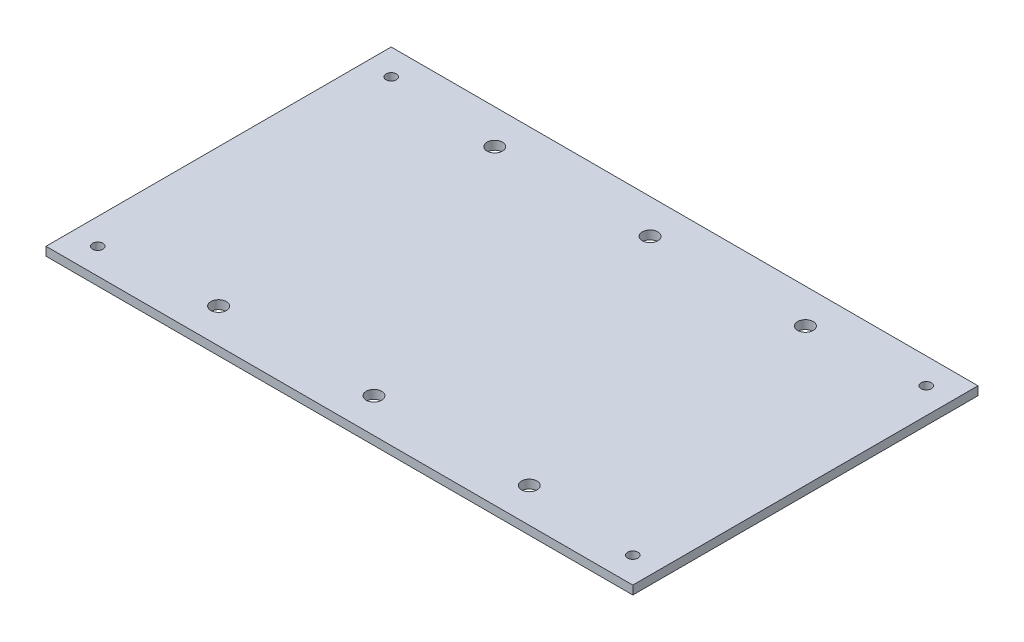
ISO-10303-21;
HEADER;
FILE_DESCRIPTION(('STEP AP214'),'2;1');
FILE_NAME('part.step','',(''),(''),'','','');
FILE_SCHEMA(('AUTOMOTIVE_DESIGN { 1 0 10303 214 1 1 1 1 }'));
ENDSEC;
DATA;
#1=APPLICATION_CONTEXT('core data for automotive mechanical design processes');
#2=APPLICATION_PROTOCOL_DEFINITION('international standard','automotive_design',2000,#1);
#3=PRODUCT_CONTEXT('',#1,'mechanical');
#4=PRODUCT('Part','Part','',(#3));
#5=PRODUCT_RELATED_PRODUCT_CATEGORY('part','',(#4));
#6=PRODUCT_DEFINITION_FORMATION('','',#4);
#7=PRODUCT_DEFINITION_CONTEXT('part definition',#1,'design');
#8=PRODUCT_DEFINITION('design','',#6,#7);
#9=PRODUCT_DEFINITION_SHAPE('','',#8);
#10=(LENGTH_UNIT() NAMED_UNIT(*) SI_UNIT(.MILLI.,.METRE.));
#11=(NAMED_UNIT(*) PLANE_ANGLE_UNIT() SI_UNIT($,.RADIAN.));
#12=(NAMED_UNIT(*) SI_UNIT($,.STERADIAN.) SOLID_ANGLE_UNIT());
#13=UNCERTAINTY_MEASURE_WITH_UNIT(LENGTH_MEASURE(1.E-05),#10,'distance_accuracy_value','');
#14=(GEOMETRIC_REPRESENTATION_CONTEXT(3) GLOBAL_UNCERTAINTY_ASSIGNED_CONTEXT((#13)) GLOBAL_UNIT_ASSIGNED_CONTEXT((#10,
#11,#12)) REPRESENTATION_CONTEXT('',''));
#15=CARTESIAN_POINT('',(0.,0.,0.));
#16=DIRECTION('',(0.,0.,1.));
#17=DIRECTION('',(1.,0.,0.));
#18=AXIS2_PLACEMENT_3D('',#15,#16,#17);
#19=CARTESIAN_POINT('',(0.,5.,0.));
#20=DIRECTION('',(0.,1.,0.));
#21=DIRECTION('',(0.,0.,1.));
#22=AXIS2_PLACEMENT_3D('',#19,#20,#21);
#23=PLANE('',#22);
#24=CARTESIAN_POINT('',(-90.,5.,80.));
#25=DIRECTION('',(0.,1.,0.));
#26=DIRECTION('',(0.,0.,1.));
#27=AXIS2_PLACEMENT_3D('',#24,#25,#26);
#28=CIRCLE('',#27,4.50000000000001);
#29=CARTESIAN_POINT('',(-90.,5.,84.5));
#30=VERTEX_POINT('',#29);
#31=EDGE_CURVE('E157',#30,#30,#28,.T.);
#32=ORIENTED_EDGE('',*,*,#31,.F.);
#33=EDGE_LOOP('',(#32));
#34=FACE_BOUND('',#33,.T.);
#35=CARTESIAN_POINT('',(90.,5.,-80.));
#36=DIRECTION('',(0.,1.,0.));
#37=DIRECTION('',(0.,0.,1.));
#38=AXIS2_PLACEMENT_3D('',#35,#36,#37);
#39=CIRCLE('',#38,4.50000000000001);
#40=CARTESIAN_POINT('',(90.,5.,-75.5));
#41=VERTEX_POINT('',#40);
#42=EDGE_CURVE('E145',#41,#41,#39,.T.);
#43=ORIENTED_EDGE('',*,*,#42,.F.);
#44=EDGE_LOOP('',(#43));
#45=FACE_BOUND('',#44,.T.);
#46=CARTESIAN_POINT('',(0.,5.,-80.));
#47=DIRECTION('',(0.,1.,0.));
#48=DIRECTION('',(0.,0.,1.));
#49=AXIS2_PLACEMENT_3D('',#46,#47,#48);
#50=CIRCLE('',#49,4.5);
#51=CARTESIAN_POINT('',(0.,5.,-75.5));
#52=VERTEX_POINT('',#51);
#53=EDGE_CURVE('E133',#52,#52,#50,.T.);
#54=ORIENTED_EDGE('',*,*,#53,.F.);
#55=EDGE_LOOP('',(#54));
#56=FACE_BOUND('',#55,.T.);
#57=CARTESIAN_POINT('',(-155.000000000001,5.,84.9999999999991));
#58=DIRECTION('',(0.,1.,0.));
#59=DIRECTION('',(0.,0.,1.));
#60=AXIS2_PLACEMENT_3D('',#57,#58,#59);
#61=CIRCLE('',#60,3.00000000000005);
#62=CARTESIAN_POINT('',(-155.000000000001,5.,87.9999999999992));
#63=VERTEX_POINT('',#62);
#64=EDGE_CURVE('E121',#63,#63,#61,.T.);
#65=ORIENTED_EDGE('',*,*,#64,.F.);
#66=EDGE_LOOP('',(#65));
#67=FACE_BOUND('',#66,.T.);
#68=CARTESIAN_POINT('',(155.,5.,-85.));
#69=DIRECTION('',(0.,1.,0.));
#70=DIRECTION('',(0.,0.,1.));
#71=AXIS2_PLACEMENT_3D('',#68,#69,#70);
#72=CIRCLE('',#71,2.99999999999999);
#73=CARTESIAN_POINT('',(155.,5.,-82.));
#74=VERTEX_POINT('',#73);
#75=EDGE_CURVE('E100',#74,#74,#72,.T.);
#76=ORIENTED_EDGE('',*,*,#75,.F.);
#77=EDGE_LOOP('',(#76));
#78=FACE_BOUND('',#77,.T.);
#79=DIRECTION('',(0.,0.,-1.));
#80=VECTOR('',#79,1.);
#81=CARTESIAN_POINT('',(170.,5.,-100.));
#82=LINE('',#81,#80);
#83=CARTESIAN_POINT('',(170.,5.,100.));
#84=VERTEX_POINT('',#83);
#85=CARTESIAN_POINT('',(170.,5.,-100.));
#86=VERTEX_POINT('',#85);
#87=EDGE_CURVE('E85',#84,#86,#82,.T.);
#88=ORIENTED_EDGE('',*,*,#87,.T.);
#89=DIRECTION('',(-1.,0.,0.));
#90=VECTOR('',#89,1.);
#91=CARTESIAN_POINT('',(-170.,5.,-100.));
#92=LINE('',#91,#90);
#93=CARTESIAN_POINT('',(-170.,5.,-100.));
#94=VERTEX_POINT('',#93);
#95=EDGE_CURVE('E80',#86,#94,#92,.T.);
#96=ORIENTED_EDGE('',*,*,#95,.T.);
#97=DIRECTION('',(0.,0.,1.));
#98=VECTOR('',#97,1.);
#99=CARTESIAN_POINT('',(-170.,5.,-100.));
#100=LINE('',#99,#98);
#101=CARTESIAN_POINT('',(-170.,5.,100.));
#102=VERTEX_POINT('',#101);
#103=EDGE_CURVE('E83',#94,#102,#100,.T.);
#104=ORIENTED_EDGE('',*,*,#103,.T.);
#105=DIRECTION('',(1.,0.,0.));
#106=VECTOR('',#105,1.);
#107=CARTESIAN_POINT('',(-170.,5.,100.));
#108=LINE('',#107,#106);
#109=EDGE_CURVE('E50',#102,#84,#108,.T.);
#110=ORIENTED_EDGE('',*,*,#109,.T.);
#111=EDGE_LOOP('',(#88,#96,#104,#110));
#112=FACE_BOUND('',#111,.T.);
#113=CARTESIAN_POINT('',(-155.000000000001,5.,-84.9999999999991));
#114=DIRECTION('',(0.,1.,0.));
#115=DIRECTION('',(0.,0.,-1.));
#116=AXIS2_PLACEMENT_3D('',#113,#114,#115);
#117=CIRCLE('',#116,3.00000000000005);
#118=CARTESIAN_POINT('',(-155.000000000001,5.,-87.9999999999992));
#119=VERTEX_POINT('',#118);
#120=EDGE_CURVE('E115',#119,#119,#117,.T.);
#121=ORIENTED_EDGE('',*,*,#120,.F.);
#122=EDGE_LOOP('',(#121));
#123=FACE_BOUND('',#122,.T.);
#124=CARTESIAN_POINT('',(155.,5.,85.));
#125=DIRECTION('',(0.,1.,0.));
#126=DIRECTION('',(0.,0.,-1.));
#127=AXIS2_PLACEMENT_3D('',#124,#125,#126);
#128=CIRCLE('',#127,2.99999999999999);
#129=CARTESIAN_POINT('',(155.,5.,82.));
#130=VERTEX_POINT('',#129);
#131=EDGE_CURVE('E127',#130,#130,#128,.T.);
#132=ORIENTED_EDGE('',*,*,#131,.F.);
#133=EDGE_LOOP('',(#132));
#134=FACE_BOUND('',#133,.T.);
#135=CARTESIAN_POINT('',(0.,5.,80.));
#136=DIRECTION('',(0.,1.,0.));
#137=DIRECTION('',(0.,0.,-1.));
#138=AXIS2_PLACEMENT_3D('',#135,#136,#137);
#139=CIRCLE('',#138,4.5);
#140=CARTESIAN_POINT('',(0.,5.,75.5));
#141=VERTEX_POINT('',#140);
#142=EDGE_CURVE('E139',#141,#141,#139,.T.);
#143=ORIENTED_EDGE('',*,*,#142,.F.);
#144=EDGE_LOOP('',(#143));
#145=FACE_BOUND('',#144,.T.);
#146=CARTESIAN_POINT('',(90.,5.,80.));
#147=DIRECTION('',(0.,1.,0.));
#148=DIRECTION('',(0.,0.,-1.));
#149=AXIS2_PLACEMENT_3D('',#146,#147,#148);
#150=CIRCLE('',#149,4.50000000000001);
#151=CARTESIAN_POINT('',(90.,5.,75.5));
#152=VERTEX_POINT('',#151);
#153=EDGE_CURVE('E151',#152,#152,#150,.T.);
#154=ORIENTED_EDGE('',*,*,#153,.F.);
#155=EDGE_LOOP('',(#154));
#156=FACE_BOUND('',#155,.T.);
#157=CARTESIAN_POINT('',(-90.,5.,-80.));
#158=DIRECTION('',(0.,1.,0.));
#159=DIRECTION('',(0.,0.,-1.));
#160=AXIS2_PLACEMENT_3D('',#157,#158,#159);
#161=CIRCLE('',#160,4.50000000000001);
#162=CARTESIAN_POINT('',(-90.,5.,-84.5));
#163=VERTEX_POINT('',#162);
#164=EDGE_CURVE('E163',#163,#163,#161,.T.);
#165=ORIENTED_EDGE('',*,*,#164,.F.);
#166=EDGE_LOOP('',(#165));
#167=FACE_BOUND('',#166,.T.);
#168=ADVANCED_FACE('F33',(#34,#45,#56,#67,#78,#112,#123,#134,#145,#156,#167),#23,.T.);
#169=CARTESIAN_POINT('',(0.,0.,0.));
#170=DIRECTION('',(0.,1.,0.));
#171=DIRECTION('',(0.,0.,1.));
#172=AXIS2_PLACEMENT_3D('',#169,#170,#171);
#173=PLANE('',#172);
#174=DIRECTION('',(0.,0.,-1.));
#175=VECTOR('',#174,1.);
#176=CARTESIAN_POINT('',(170.,0.,-100.));
#177=LINE('',#176,#175);
#178=CARTESIAN_POINT('',(170.,0.,100.));
#179=VERTEX_POINT('',#178);
#180=CARTESIAN_POINT('',(170.,0.,-100.));
#181=VERTEX_POINT('',#180);
#182=EDGE_CURVE('E97',#179,#181,#177,.T.);
#183=ORIENTED_EDGE('',*,*,#182,.F.);
#184=DIRECTION('',(1.,0.,0.));
#185=VECTOR('',#184,1.);
#186=CARTESIAN_POINT('',(-170.,0.,100.));
#187=LINE('',#186,#185);
#188=CARTESIAN_POINT('',(-170.,0.,100.));
#189=VERTEX_POINT('',#188);
#190=EDGE_CURVE('E73',#189,#179,#187,.T.);
#191=ORIENTED_EDGE('',*,*,#190,.F.);
#192=DIRECTION('',(0.,0.,1.));
#193=VECTOR('',#192,1.);
#194=CARTESIAN_POINT('',(-170.,0.,-100.));
#195=LINE('',#194,#193);
#196=CARTESIAN_POINT('',(-170.,0.,-100.));
#197=VERTEX_POINT('',#196);
#198=EDGE_CURVE('E67',#197,#189,#195,.T.);
#199=ORIENTED_EDGE('',*,*,#198,.F.);
#200=DIRECTION('',(-1.,0.,0.));
#201=VECTOR('',#200,1.);
#202=CARTESIAN_POINT('',(-170.,0.,-100.));
#203=LINE('',#202,#201);
#204=EDGE_CURVE('E89',#181,#197,#203,.T.);
#205=ORIENTED_EDGE('',*,*,#204,.F.);
#206=EDGE_LOOP('',(#183,#191,#199,#205));
#207=FACE_BOUND('',#206,.T.);
#208=CARTESIAN_POINT('',(155.,0.,-85.));
#209=DIRECTION('',(0.,1.,0.));
#210=DIRECTION('',(0.,0.,1.));
#211=AXIS2_PLACEMENT_3D('',#208,#209,#210);
#212=CIRCLE('',#211,2.99999999999999);
#213=CARTESIAN_POINT('',(155.,0.,-82.));
#214=VERTEX_POINT('',#213);
#215=EDGE_CURVE('E112',#214,#214,#212,.T.);
#216=ORIENTED_EDGE('',*,*,#215,.T.);
#217=EDGE_LOOP('',(#216));
#218=FACE_BOUND('',#217,.T.);
#219=CARTESIAN_POINT('',(-155.000000000001,0.,-84.9999999999991));
#220=DIRECTION('',(0.,1.,0.));
#221=DIRECTION('',(0.,0.,-1.));
#222=AXIS2_PLACEMENT_3D('',#219,#220,#221);
#223=CIRCLE('',#222,3.00000000000005);
#224=CARTESIAN_POINT('',(-155.000000000001,0.,-87.9999999999992));
#225=VERTEX_POINT('',#224);
#226=EDGE_CURVE('E118',#225,#225,#223,.T.);
#227=ORIENTED_EDGE('',*,*,#226,.T.);
#228=EDGE_LOOP('',(#227));
#229=FACE_BOUND('',#228,.T.);
#230=CARTESIAN_POINT('',(-155.000000000001,0.,84.9999999999991));
#231=DIRECTION('',(0.,1.,0.));
#232=DIRECTION('',(0.,0.,1.));
#233=AXIS2_PLACEMENT_3D('',#230,#231,#232);
#234=CIRCLE('',#233,3.00000000000005);
#235=CARTESIAN_POINT('',(-155.000000000001,0.,87.9999999999992));
#236=VERTEX_POINT('',#235);
#237=EDGE_CURVE('E124',#236,#236,#234,.T.);
#238=ORIENTED_EDGE('',*,*,#237,.T.);
#239=EDGE_LOOP('',(#238));
#240=FACE_BOUND('',#239,.T.);
#241=CARTESIAN_POINT('',(155.,0.,85.));
#242=DIRECTION('',(0.,1.,0.));
#243=DIRECTION('',(0.,0.,-1.));
#244=AXIS2_PLACEMENT_3D('',#241,#242,#243);
#245=CIRCLE('',#244,2.99999999999999);
#246=CARTESIAN_POINT('',(155.,0.,82.));
#247=VERTEX_POINT('',#246);
#248=EDGE_CURVE('E130',#247,#247,#245,.T.);
#249=ORIENTED_EDGE('',*,*,#248,.T.);
#250=EDGE_LOOP('',(#249));
#251=FACE_BOUND('',#250,.T.);
#252=CARTESIAN_POINT('',(0.,0.,-80.));
#253=DIRECTION('',(0.,1.,0.));
#254=DIRECTION('',(0.,0.,1.));
#255=AXIS2_PLACEMENT_3D('',#252,#253,#254);
#256=CIRCLE('',#255,4.5);
#257=CARTESIAN_POINT('',(0.,0.,-75.5));
#258=VERTEX_POINT('',#257);
#259=EDGE_CURVE('E136',#258,#258,#256,.T.);
#260=ORIENTED_EDGE('',*,*,#259,.T.);
#261=EDGE_LOOP('',(#260));
#262=FACE_BOUND('',#261,.T.);
#263=CARTESIAN_POINT('',(0.,0.,80.));
#264=DIRECTION('',(0.,1.,0.));
#265=DIRECTION('',(0.,0.,-1.));
#266=AXIS2_PLACEMENT_3D('',#263,#264,#265);
#267=CIRCLE('',#266,4.5);
#268=CARTESIAN_POINT('',(0.,0.,75.5));
#269=VERTEX_POINT('',#268);
#270=EDGE_CURVE('E142',#269,#269,#267,.T.);
#271=ORIENTED_EDGE('',*,*,#270,.T.);
#272=EDGE_LOOP('',(#271));
#273=FACE_BOUND('',#272,.T.);
#274=CARTESIAN_POINT('',(90.,0.,-80.));
#275=DIRECTION('',(0.,1.,0.));
#276=DIRECTION('',(0.,0.,1.));
#277=AXIS2_PLACEMENT_3D('',#274,#275,#276);
#278=CIRCLE('',#277,4.50000000000001);
#279=CARTESIAN_POINT('',(90.,0.,-75.5));
#280=VERTEX_POINT('',#279);
#281=EDGE_CURVE('E148',#280,#280,#278,.T.);
#282=ORIENTED_EDGE('',*,*,#281,.T.);
#283=EDGE_LOOP('',(#282));
#284=FACE_BOUND('',#283,.T.);
#285=CARTESIAN_POINT('',(90.,0.,80.));
#286=DIRECTION('',(0.,1.,0.));
#287=DIRECTION('',(0.,0.,-1.));
#288=AXIS2_PLACEMENT_3D('',#285,#286,#287);
#289=CIRCLE('',#288,4.50000000000001);
#290=CARTESIAN_POINT('',(90.,0.,75.5));
#291=VERTEX_POINT('',#290);
#292=EDGE_CURVE('E154',#291,#291,#289,.T.);
#293=ORIENTED_EDGE('',*,*,#292,.T.);
#294=EDGE_LOOP('',(#293));
#295=FACE_BOUND('',#294,.T.);
#296=CARTESIAN_POINT('',(-90.,0.,80.));
#297=DIRECTION('',(0.,1.,0.));
#298=DIRECTION('',(0.,0.,1.));
#299=AXIS2_PLACEMENT_3D('',#296,#297,#298);
#300=CIRCLE('',#299,4.50000000000001);
#301=CARTESIAN_POINT('',(-90.,0.,84.5));
#302=VERTEX_POINT('',#301);
#303=EDGE_CURVE('E160',#302,#302,#300,.T.);
#304=ORIENTED_EDGE('',*,*,#303,.T.);
#305=EDGE_LOOP('',(#304));
#306=FACE_BOUND('',#305,.T.);
#307=CARTESIAN_POINT('',(-90.,0.,-80.));
#308=DIRECTION('',(0.,1.,0.));
#309=DIRECTION('',(0.,0.,-1.));
#310=AXIS2_PLACEMENT_3D('',#307,#308,#309);
#311=CIRCLE('',#310,4.50000000000001);
#312=CARTESIAN_POINT('',(-90.,0.,-84.5));
#313=VERTEX_POINT('',#312);
#314=EDGE_CURVE('E166',#313,#313,#311,.T.);
#315=ORIENTED_EDGE('',*,*,#314,.T.);
#316=EDGE_LOOP('',(#315));
#317=FACE_BOUND('',#316,.T.);
#318=ADVANCED_FACE('F108',(#207,#218,#229,#240,#251,#262,#273,#284,#295,#306,#317),#173,.F.);
#319=CARTESIAN_POINT('',(170.,5.,-100.));
#320=DIRECTION('',(-1.,0.,0.));
#321=DIRECTION('',(0.,0.,1.));
#322=AXIS2_PLACEMENT_3D('',#319,#320,#321);
#323=PLANE('',#322);
#324=ORIENTED_EDGE('',*,*,#182,.T.);
#325=DIRECTION('',(0.,-1.,0.));
#326=VECTOR('',#325,1.);
#327=CARTESIAN_POINT('',(170.,5.,-100.));
#328=LINE('',#327,#326);
#329=EDGE_CURVE('E11',#86,#181,#328,.T.);
#330=ORIENTED_EDGE('',*,*,#329,.F.);
#331=ORIENTED_EDGE('',*,*,#87,.F.);
#332=DIRECTION('',(0.,-1.,0.));
#333=VECTOR('',#332,1.);
#334=CARTESIAN_POINT('',(170.,5.,100.));
#335=LINE('',#334,#333);
#336=EDGE_CURVE('E93',#84,#179,#335,.T.);
#337=ORIENTED_EDGE('',*,*,#336,.T.);
#338=EDGE_LOOP('',(#324,#330,#331,#337));
#339=FACE_BOUND('',#338,.T.);
#340=ADVANCED_FACE('F35',(#339),#323,.F.);
#341=CARTESIAN_POINT('',(-170.,5.,-100.));
#342=DIRECTION('',(0.,0.,1.));
#343=DIRECTION('',(1.,0.,0.));
#344=AXIS2_PLACEMENT_3D('',#341,#342,#343);
#345=PLANE('',#344);
#346=ORIENTED_EDGE('',*,*,#204,.T.);
#347=DIRECTION('',(0.,-1.,0.));
#348=VECTOR('',#347,1.);
#349=CARTESIAN_POINT('',(-170.,5.,-100.));
#350=LINE('',#349,#348);
#351=EDGE_CURVE('E42',#94,#197,#350,.T.);
#352=ORIENTED_EDGE('',*,*,#351,.F.);
#353=ORIENTED_EDGE('',*,*,#95,.F.);
#354=ORIENTED_EDGE('',*,*,#329,.T.);
#355=EDGE_LOOP('',(#346,#352,#353,#354));
#356=FACE_BOUND('',#355,.T.);
#357=ADVANCED_FACE('F88',(#356),#345,.F.);
#358=CARTESIAN_POINT('',(-170.,5.,-100.));
#359=DIRECTION('',(1.,0.,0.));
#360=DIRECTION('',(0.,0.,-1.));
#361=AXIS2_PLACEMENT_3D('',#358,#359,#360);
#362=PLANE('',#361);
#363=ORIENTED_EDGE('',*,*,#198,.T.);
#364=DIRECTION('',(0.,-1.,0.));
#365=VECTOR('',#364,1.);
#366=CARTESIAN_POINT('',(-170.,5.,100.));
#367=LINE('',#366,#365);
#368=EDGE_CURVE('E90',#102,#189,#367,.T.);
#369=ORIENTED_EDGE('',*,*,#368,.F.);
#370=ORIENTED_EDGE('',*,*,#103,.F.);
#371=ORIENTED_EDGE('',*,*,#351,.T.);
#372=EDGE_LOOP('',(#363,#369,#370,#371));
#373=FACE_BOUND('',#372,.T.);
#374=ADVANCED_FACE('F91',(#373),#362,.F.);
#375=CARTESIAN_POINT('',(-170.,5.,100.));
#376=DIRECTION('',(0.,0.,-1.));
#377=DIRECTION('',(-1.,0.,0.));
#378=AXIS2_PLACEMENT_3D('',#375,#376,#377);
#379=PLANE('',#378);
#380=ORIENTED_EDGE('',*,*,#190,.T.);
#381=ORIENTED_EDGE('',*,*,#336,.F.);
#382=ORIENTED_EDGE('',*,*,#109,.F.);
#383=ORIENTED_EDGE('',*,*,#368,.T.);
#384=EDGE_LOOP('',(#380,#381,#382,#383));
#385=FACE_BOUND('',#384,.T.);
#386=ADVANCED_FACE('F105',(#385),#379,.F.);
#387=CARTESIAN_POINT('',(155.,5.,-85.));
#388=DIRECTION('',(0.,-1.,0.));
#389=DIRECTION('',(0.,0.,-1.));
#390=AXIS2_PLACEMENT_3D('',#387,#388,#389);
#391=CYLINDRICAL_SURFACE('',#390,2.99999999999999);
#392=ORIENTED_EDGE('',*,*,#75,.T.);
#393=EDGE_LOOP('',(#392));
#394=FACE_BOUND('',#393,.T.);
#395=ORIENTED_EDGE('',*,*,#215,.F.);
#396=EDGE_LOOP('',(#395));
#397=FACE_BOUND('',#396,.T.);
#398=ADVANCED_FACE('F185',(#394,#397),#391,.F.);
#399=CARTESIAN_POINT('',(-155.000000000001,5.,-84.9999999999991));
#400=DIRECTION('',(0.,-1.,0.));
#401=DIRECTION('',(0.,0.,-1.));
#402=AXIS2_PLACEMENT_3D('',#399,#400,#401);
#403=CYLINDRICAL_SURFACE('',#402,3.00000000000005);
#404=ORIENTED_EDGE('',*,*,#120,.T.);
#405=EDGE_LOOP('',(#404));
#406=FACE_BOUND('',#405,.T.);
#407=ORIENTED_EDGE('',*,*,#226,.F.);
#408=EDGE_LOOP('',(#407));
#409=FACE_BOUND('',#408,.T.);
#410=ADVANCED_FACE('F231',(#406,#409),#403,.F.);
#411=CARTESIAN_POINT('',(-155.000000000001,5.,84.9999999999991));
#412=DIRECTION('',(0.,-1.,0.));
#413=DIRECTION('',(0.,0.,-1.));
#414=AXIS2_PLACEMENT_3D('',#411,#412,#413);
#415=CYLINDRICAL_SURFACE('',#414,3.00000000000005);
#416=ORIENTED_EDGE('',*,*,#64,.T.);
#417=EDGE_LOOP('',(#416));
#418=FACE_BOUND('',#417,.T.);
#419=ORIENTED_EDGE('',*,*,#237,.F.);
#420=EDGE_LOOP('',(#419));
#421=FACE_BOUND('',#420,.T.);
#422=ADVANCED_FACE('F239',(#418,#421),#415,.F.);
#423=CARTESIAN_POINT('',(155.,5.,85.));
#424=DIRECTION('',(0.,-1.,0.));
#425=DIRECTION('',(0.,0.,-1.));
#426=AXIS2_PLACEMENT_3D('',#423,#424,#425);
#427=CYLINDRICAL_SURFACE('',#426,2.99999999999999);
#428=ORIENTED_EDGE('',*,*,#131,.T.);
#429=EDGE_LOOP('',(#428));
#430=FACE_BOUND('',#429,.T.);
#431=ORIENTED_EDGE('',*,*,#248,.F.);
#432=EDGE_LOOP('',(#431));
#433=FACE_BOUND('',#432,.T.);
#434=ADVANCED_FACE('F247',(#430,#433),#427,.F.);
#435=CARTESIAN_POINT('',(0.,5.,-80.));
#436=DIRECTION('',(0.,-1.,0.));
#437=DIRECTION('',(0.,0.,-1.));
#438=AXIS2_PLACEMENT_3D('',#435,#436,#437);
#439=CYLINDRICAL_SURFACE('',#438,4.5);
#440=ORIENTED_EDGE('',*,*,#53,.T.);
#441=EDGE_LOOP('',(#440));
#442=FACE_BOUND('',#441,.T.);
#443=ORIENTED_EDGE('',*,*,#259,.F.);
#444=EDGE_LOOP('',(#443));
#445=FACE_BOUND('',#444,.T.);
#446=ADVANCED_FACE('F256',(#442,#445),#439,.F.);
#447=CARTESIAN_POINT('',(0.,5.,80.));
#448=DIRECTION('',(0.,-1.,0.));
#449=DIRECTION('',(0.,0.,-1.));
#450=AXIS2_PLACEMENT_3D('',#447,#448,#449);
#451=CYLINDRICAL_SURFACE('',#450,4.5);
#452=ORIENTED_EDGE('',*,*,#142,.T.);
#453=EDGE_LOOP('',(#452));
#454=FACE_BOUND('',#453,.T.);
#455=ORIENTED_EDGE('',*,*,#270,.F.);
#456=EDGE_LOOP('',(#455));
#457=FACE_BOUND('',#456,.T.);
#458=ADVANCED_FACE('F265',(#454,#457),#451,.F.);
#459=CARTESIAN_POINT('',(90.,5.,-80.));
#460=DIRECTION('',(0.,-1.,0.));
#461=DIRECTION('',(0.,0.,-1.));
#462=AXIS2_PLACEMENT_3D('',#459,#460,#461);
#463=CYLINDRICAL_SURFACE('',#462,4.50000000000001);
#464=ORIENTED_EDGE('',*,*,#42,.T.);
#465=EDGE_LOOP('',(#464));
#466=FACE_BOUND('',#465,.T.);
#467=ORIENTED_EDGE('',*,*,#281,.F.);
#468=EDGE_LOOP('',(#467));
#469=FACE_BOUND('',#468,.T.);
#470=ADVANCED_FACE('F274',(#466,#469),#463,.F.);
#471=CARTESIAN_POINT('',(90.,5.,80.));
#472=DIRECTION('',(0.,-1.,0.));
#473=DIRECTION('',(0.,0.,-1.));
#474=AXIS2_PLACEMENT_3D('',#471,#472,#473);
#475=CYLINDRICAL_SURFACE('',#474,4.50000000000001);
#476=ORIENTED_EDGE('',*,*,#153,.T.);
#477=EDGE_LOOP('',(#476));
#478=FACE_BOUND('',#477,.T.);
#479=ORIENTED_EDGE('',*,*,#292,.F.);
#480=EDGE_LOOP('',(#479));
#481=FACE_BOUND('',#480,.T.);
#482=ADVANCED_FACE('F283',(#478,#481),#475,.F.);
#483=CARTESIAN_POINT('',(-90.,5.,80.));
#484=DIRECTION('',(0.,-1.,0.));
#485=DIRECTION('',(0.,0.,-1.));
#486=AXIS2_PLACEMENT_3D('',#483,#484,#485);
#487=CYLINDRICAL_SURFACE('',#486,4.50000000000001);
#488=ORIENTED_EDGE('',*,*,#31,.T.);
#489=EDGE_LOOP('',(#488));
#490=FACE_BOUND('',#489,.T.);
#491=ORIENTED_EDGE('',*,*,#303,.F.);
#492=EDGE_LOOP('',(#491));
#493=FACE_BOUND('',#492,.T.);
#494=ADVANCED_FACE('F292',(#490,#493),#487,.F.);
#495=CARTESIAN_POINT('',(-90.,5.,-80.));
#496=DIRECTION('',(0.,-1.,0.));
#497=DIRECTION('',(0.,0.,-1.));
#498=AXIS2_PLACEMENT_3D('',#495,#496,#497);
#499=CYLINDRICAL_SURFACE('',#498,4.50000000000001);
#500=ORIENTED_EDGE('',*,*,#164,.T.);
#501=EDGE_LOOP('',(#500));
#502=FACE_BOUND('',#501,.T.);
#503=ORIENTED_EDGE('',*,*,#314,.F.);
#504=EDGE_LOOP('',(#503));
#505=FACE_BOUND('',#504,.T.);
#506=ADVANCED_FACE('F172',(#502,#505),#499,.F.);
#507=CLOSED_SHELL('',(#168,#318,#340,#357,#374,#386,#398,#410,#422,#434,#446,#458,#470,#482,
#494,#506));
#508=MANIFOLD_SOLID_BREP('B2',#507);
#509=ADVANCED_BREP_SHAPE_REPRESENTATION('',(#18,#508),#14);
#510=SHAPE_DEFINITION_REPRESENTATION(#9,#509);
ENDSEC;
END-ISO-10303-21;
